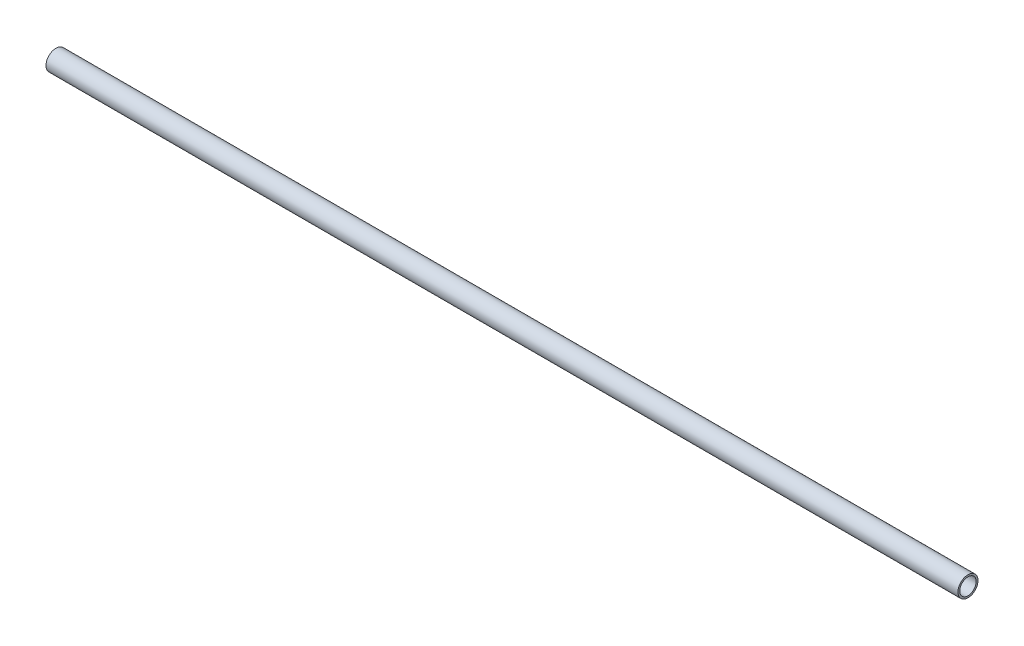
ISO-10303-21;
HEADER;
FILE_DESCRIPTION(('STEP AP214'),'2;1');
FILE_NAME('part.step','',(''),(''),'','','');
FILE_SCHEMA(('AUTOMOTIVE_DESIGN { 1 0 10303 214 1 1 1 1 }'));
ENDSEC;
DATA;
#1=APPLICATION_CONTEXT('core data for automotive mechanical design processes');
#2=APPLICATION_PROTOCOL_DEFINITION('international standard','automotive_design',2000,#1);
#3=PRODUCT_CONTEXT('',#1,'mechanical');
#4=PRODUCT('Part','Part','',(#3));
#5=PRODUCT_RELATED_PRODUCT_CATEGORY('part','',(#4));
#6=PRODUCT_DEFINITION_FORMATION('','',#4);
#7=PRODUCT_DEFINITION_CONTEXT('part definition',#1,'design');
#8=PRODUCT_DEFINITION('design','',#6,#7);
#9=PRODUCT_DEFINITION_SHAPE('','',#8);
#10=(LENGTH_UNIT() NAMED_UNIT(*) SI_UNIT(.MILLI.,.METRE.));
#11=(NAMED_UNIT(*) PLANE_ANGLE_UNIT() SI_UNIT($,.RADIAN.));
#12=(NAMED_UNIT(*) SI_UNIT($,.STERADIAN.) SOLID_ANGLE_UNIT());
#13=UNCERTAINTY_MEASURE_WITH_UNIT(LENGTH_MEASURE(1.E-05),#10,'distance_accuracy_value','');
#14=(GEOMETRIC_REPRESENTATION_CONTEXT(3) GLOBAL_UNCERTAINTY_ASSIGNED_CONTEXT((#13)) GLOBAL_UNIT_ASSIGNED_CONTEXT((#10,
#11,#12)) REPRESENTATION_CONTEXT('',''));
#15=CARTESIAN_POINT('',(0.,0.,0.));
#16=DIRECTION('',(0.,0.,1.));
#17=DIRECTION('',(1.,0.,0.));
#18=AXIS2_PLACEMENT_3D('',#15,#16,#17);
#19=CARTESIAN_POINT('',(0.,0.,0.));
#20=DIRECTION('',(1.,0.,0.));
#21=DIRECTION('',(0.,0.,-1.));
#22=AXIS2_PLACEMENT_3D('',#19,#20,#21);
#23=CYLINDRICAL_SURFACE('',#22,45.);
#24=CARTESIAN_POINT('',(0.,0.,0.));
#25=DIRECTION('',(1.,0.,0.));
#26=DIRECTION('',(0.,0.,-1.));
#27=AXIS2_PLACEMENT_3D('',#24,#25,#26);
#28=CIRCLE('',#27,45.);
#29=CARTESIAN_POINT('',(0.,0.,-45.));
#30=VERTEX_POINT('',#29);
#31=EDGE_CURVE('E16',#30,#30,#28,.T.);
#32=ORIENTED_EDGE('',*,*,#31,.F.);
#33=EDGE_LOOP('',(#32));
#34=FACE_BOUND('',#33,.T.);
#35=CARTESIAN_POINT('',(5000.,0.,0.));
#36=DIRECTION('',(1.,0.,0.));
#37=DIRECTION('',(0.,0.,-1.));
#38=AXIS2_PLACEMENT_3D('',#35,#36,#37);
#39=CIRCLE('',#38,45.);
#40=CARTESIAN_POINT('',(5000.,0.,-45.));
#41=VERTEX_POINT('',#40);
#42=EDGE_CURVE('E25',#41,#41,#39,.F.);
#43=ORIENTED_EDGE('',*,*,#42,.F.);
#44=EDGE_LOOP('',(#43));
#45=FACE_BOUND('',#44,.T.);
#46=ADVANCED_FACE('F13',(#34,#45),#23,.F.);
#47=CARTESIAN_POINT('',(0.,-55.660002108172,-55.));
#48=DIRECTION('',(-1.,0.,0.));
#49=DIRECTION('',(0.,0.,1.));
#50=AXIS2_PLACEMENT_3D('',#47,#48,#49);
#51=PLANE('',#50);
#52=ORIENTED_EDGE('',*,*,#31,.T.);
#53=EDGE_LOOP('',(#52));
#54=FACE_BOUND('',#53,.T.);
#55=CARTESIAN_POINT('',(0.,0.,0.));
#56=DIRECTION('',(1.,0.,0.));
#57=DIRECTION('',(0.,0.,-1.));
#58=AXIS2_PLACEMENT_3D('',#55,#56,#57);
#59=CIRCLE('',#58,55.);
#60=CARTESIAN_POINT('',(0.,0.,-55.));
#61=VERTEX_POINT('',#60);
#62=EDGE_CURVE('E20',#61,#61,#59,.T.);
#63=ORIENTED_EDGE('',*,*,#62,.F.);
#64=EDGE_LOOP('',(#63));
#65=FACE_BOUND('',#64,.T.);
#66=ADVANCED_FACE('F33',(#54,#65),#51,.T.);
#67=CARTESIAN_POINT('',(5000.,-55.660002108172,55.));
#68=DIRECTION('',(1.,0.,0.));
#69=DIRECTION('',(0.,0.,-1.));
#70=AXIS2_PLACEMENT_3D('',#67,#68,#69);
#71=PLANE('',#70);
#72=ORIENTED_EDGE('',*,*,#42,.T.);
#73=EDGE_LOOP('',(#72));
#74=FACE_BOUND('',#73,.T.);
#75=CARTESIAN_POINT('',(5000.,0.,0.));
#76=DIRECTION('',(1.,0.,0.));
#77=DIRECTION('',(0.,0.,-1.));
#78=AXIS2_PLACEMENT_3D('',#75,#76,#77);
#79=CIRCLE('',#78,55.);
#80=CARTESIAN_POINT('',(5000.,0.,-55.));
#81=VERTEX_POINT('',#80);
#82=EDGE_CURVE('E8',#81,#81,#79,.F.);
#83=ORIENTED_EDGE('',*,*,#82,.F.);
#84=EDGE_LOOP('',(#83));
#85=FACE_BOUND('',#84,.T.);
#86=ADVANCED_FACE('F42',(#74,#85),#71,.T.);
#87=CARTESIAN_POINT('',(5000.,0.,0.));
#88=DIRECTION('',(1.,0.,0.));
#89=DIRECTION('',(0.,0.,-1.));
#90=AXIS2_PLACEMENT_3D('',#87,#88,#89);
#91=CYLINDRICAL_SURFACE('',#90,55.);
#92=ORIENTED_EDGE('',*,*,#62,.T.);
#93=EDGE_LOOP('',(#92));
#94=FACE_BOUND('',#93,.T.);
#95=ORIENTED_EDGE('',*,*,#82,.T.);
#96=EDGE_LOOP('',(#95));
#97=FACE_BOUND('',#96,.T.);
#98=ADVANCED_FACE('F43',(#94,#97),#91,.T.);
#99=CLOSED_SHELL('',(#46,#66,#86,#98));
#100=MANIFOLD_SOLID_BREP('B1',#99);
#101=ADVANCED_BREP_SHAPE_REPRESENTATION('',(#18,#100),#14);
#102=SHAPE_DEFINITION_REPRESENTATION(#9,#101);
ENDSEC;
END-ISO-10303-21;
